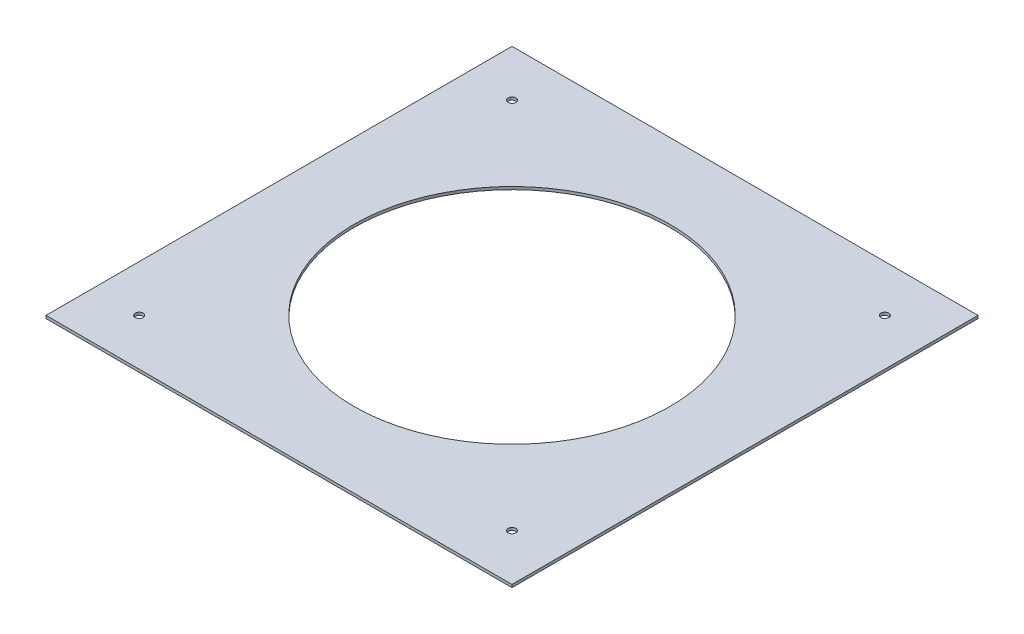
ISO-10303-21;
HEADER;
FILE_DESCRIPTION(('STEP AP214'),'2;1');
FILE_NAME('part.step','',(''),(''),'','','');
FILE_SCHEMA(('AUTOMOTIVE_DESIGN { 1 0 10303 214 1 1 1 1 }'));
ENDSEC;
DATA;
#1=APPLICATION_CONTEXT('core data for automotive mechanical design processes');
#2=APPLICATION_PROTOCOL_DEFINITION('international standard','automotive_design',2000,#1);
#3=PRODUCT_CONTEXT('',#1,'mechanical');
#4=PRODUCT('Part','Part','',(#3));
#5=PRODUCT_RELATED_PRODUCT_CATEGORY('part','',(#4));
#6=PRODUCT_DEFINITION_FORMATION('','',#4);
#7=PRODUCT_DEFINITION_CONTEXT('part definition',#1,'design');
#8=PRODUCT_DEFINITION('design','',#6,#7);
#9=PRODUCT_DEFINITION_SHAPE('','',#8);
#10=(LENGTH_UNIT() NAMED_UNIT(*) SI_UNIT(.MILLI.,.METRE.));
#11=(NAMED_UNIT(*) PLANE_ANGLE_UNIT() SI_UNIT($,.RADIAN.));
#12=(NAMED_UNIT(*) SI_UNIT($,.STERADIAN.) SOLID_ANGLE_UNIT());
#13=UNCERTAINTY_MEASURE_WITH_UNIT(LENGTH_MEASURE(1.E-05),#10,'distance_accuracy_value','');
#14=(GEOMETRIC_REPRESENTATION_CONTEXT(3) GLOBAL_UNCERTAINTY_ASSIGNED_CONTEXT((#13)) GLOBAL_UNIT_ASSIGNED_CONTEXT((#10,
#11,#12)) REPRESENTATION_CONTEXT('',''));
#15=CARTESIAN_POINT('',(0.,0.,0.));
#16=DIRECTION('',(0.,0.,1.));
#17=DIRECTION('',(1.,0.,0.));
#18=AXIS2_PLACEMENT_3D('',#15,#16,#17);
#19=CARTESIAN_POINT('',(0.,973.,0.));
#20=DIRECTION('',(0.,1.,0.));
#21=DIRECTION('',(0.,0.,1.));
#22=AXIS2_PLACEMENT_3D('',#19,#20,#21);
#23=PLANE('',#22);
#24=CARTESIAN_POINT('',(-100.,973.,100.));
#25=DIRECTION('',(0.,1.,0.));
#26=DIRECTION('',(0.,0.,-1.));
#27=AXIS2_PLACEMENT_3D('',#24,#25,#26);
#28=CIRCLE('',#27,2.1);
#29=CARTESIAN_POINT('',(-100.,973.,97.9));
#30=VERTEX_POINT('',#29);
#31=EDGE_CURVE('E131',#30,#30,#28,.T.);
#32=ORIENTED_EDGE('',*,*,#31,.F.);
#33=EDGE_LOOP('',(#32));
#34=FACE_BOUND('',#33,.T.);
#35=CARTESIAN_POINT('',(100.,973.,100.));
#36=DIRECTION('',(0.,1.,0.));
#37=DIRECTION('',(0.,0.,1.));
#38=AXIS2_PLACEMENT_3D('',#35,#36,#37);
#39=CIRCLE('',#38,2.1);
#40=CARTESIAN_POINT('',(100.,973.,102.1));
#41=VERTEX_POINT('',#40);
#42=EDGE_CURVE('E130',#41,#41,#39,.T.);
#43=ORIENTED_EDGE('',*,*,#42,.F.);
#44=EDGE_LOOP('',(#43));
#45=FACE_BOUND('',#44,.T.);
#46=CARTESIAN_POINT('',(100.,973.,-100.));
#47=DIRECTION('',(0.,1.,0.));
#48=DIRECTION('',(0.,0.,-1.));
#49=AXIS2_PLACEMENT_3D('',#46,#47,#48);
#50=CIRCLE('',#49,2.1);
#51=CARTESIAN_POINT('',(100.,973.,-102.1));
#52=VERTEX_POINT('',#51);
#53=EDGE_CURVE('E137',#52,#52,#50,.T.);
#54=ORIENTED_EDGE('',*,*,#53,.F.);
#55=EDGE_LOOP('',(#54));
#56=FACE_BOUND('',#55,.T.);
#57=CARTESIAN_POINT('',(-100.,973.,-100.));
#58=DIRECTION('',(0.,1.,0.));
#59=DIRECTION('',(0.,0.,1.));
#60=AXIS2_PLACEMENT_3D('',#57,#58,#59);
#61=CIRCLE('',#60,2.1);
#62=CARTESIAN_POINT('',(-100.,973.,-97.9));
#63=VERTEX_POINT('',#62);
#64=EDGE_CURVE('E123',#63,#63,#61,.T.);
#65=ORIENTED_EDGE('',*,*,#64,.F.);
#66=EDGE_LOOP('',(#65));
#67=FACE_BOUND('',#66,.T.);
#68=DIRECTION('',(0.,0.,1.));
#69=VECTOR('',#68,1.);
#70=CARTESIAN_POINT('',(-125.,973.,125.));
#71=LINE('',#70,#69);
#72=CARTESIAN_POINT('',(-125.,973.,-125.));
#73=VERTEX_POINT('',#72);
#74=CARTESIAN_POINT('',(-125.,973.,125.));
#75=VERTEX_POINT('',#74);
#76=EDGE_CURVE('E88',#73,#75,#71,.T.);
#77=ORIENTED_EDGE('',*,*,#76,.T.);
#78=DIRECTION('',(1.,0.,0.));
#79=VECTOR('',#78,1.);
#80=CARTESIAN_POINT('',(125.,973.,125.));
#81=LINE('',#80,#79);
#82=CARTESIAN_POINT('',(125.,973.,125.));
#83=VERTEX_POINT('',#82);
#84=EDGE_CURVE('E83',#75,#83,#81,.T.);
#85=ORIENTED_EDGE('',*,*,#84,.T.);
#86=DIRECTION('',(0.,0.,-1.));
#87=VECTOR('',#86,1.);
#88=CARTESIAN_POINT('',(125.,973.,125.));
#89=LINE('',#88,#87);
#90=CARTESIAN_POINT('',(125.,973.,-125.));
#91=VERTEX_POINT('',#90);
#92=EDGE_CURVE('E86',#83,#91,#89,.T.);
#93=ORIENTED_EDGE('',*,*,#92,.T.);
#94=DIRECTION('',(-1.,0.,0.));
#95=VECTOR('',#94,1.);
#96=CARTESIAN_POINT('',(125.,973.,-125.));
#97=LINE('',#96,#95);
#98=EDGE_CURVE('E53',#91,#73,#97,.T.);
#99=ORIENTED_EDGE('',*,*,#98,.T.);
#100=EDGE_LOOP('',(#77,#85,#93,#99));
#101=FACE_BOUND('',#100,.T.);
#102=CARTESIAN_POINT('',(0.,973.,0.));
#103=DIRECTION('',(0.,1.,0.));
#104=DIRECTION('',(0.,0.,1.));
#105=AXIS2_PLACEMENT_3D('',#102,#103,#104);
#106=CIRCLE('',#105,84.7000000000001);
#107=CARTESIAN_POINT('',(0.,973.,84.7000000000001));
#108=VERTEX_POINT('',#107);
#109=EDGE_CURVE('E103',#108,#108,#106,.T.);
#110=ORIENTED_EDGE('',*,*,#109,.F.);
#111=EDGE_LOOP('',(#110));
#112=FACE_BOUND('',#111,.T.);
#113=ADVANCED_FACE('F36',(#34,#45,#56,#67,#101,#112),#23,.T.);
#114=CARTESIAN_POINT('',(0.,971.5,0.));
#115=DIRECTION('',(0.,1.,0.));
#116=DIRECTION('',(0.,0.,1.));
#117=AXIS2_PLACEMENT_3D('',#114,#115,#116);
#118=PLANE('',#117);
#119=CARTESIAN_POINT('',(-100.,971.5,100.));
#120=DIRECTION('',(0.,1.,0.));
#121=DIRECTION('',(0.,0.,1.));
#122=AXIS2_PLACEMENT_3D('',#119,#120,#121);
#123=CIRCLE('',#122,2.1);
#124=CARTESIAN_POINT('',(-100.,971.5,102.1));
#125=VERTEX_POINT('',#124);
#126=EDGE_CURVE('E127',#125,#125,#123,.F.);
#127=ORIENTED_EDGE('',*,*,#126,.F.);
#128=EDGE_LOOP('',(#127));
#129=FACE_BOUND('',#128,.T.);
#130=CARTESIAN_POINT('',(100.,971.5,100.));
#131=DIRECTION('',(0.,1.,0.));
#132=DIRECTION('',(0.,0.,1.));
#133=AXIS2_PLACEMENT_3D('',#130,#131,#132);
#134=CIRCLE('',#133,2.1);
#135=CARTESIAN_POINT('',(100.,971.5,102.1));
#136=VERTEX_POINT('',#135);
#137=EDGE_CURVE('E134',#136,#136,#134,.F.);
#138=ORIENTED_EDGE('',*,*,#137,.F.);
#139=EDGE_LOOP('',(#138));
#140=FACE_BOUND('',#139,.T.);
#141=CARTESIAN_POINT('',(100.,971.5,-100.));
#142=DIRECTION('',(0.,1.,0.));
#143=DIRECTION('',(0.,0.,1.));
#144=AXIS2_PLACEMENT_3D('',#141,#142,#143);
#145=CIRCLE('',#144,2.1);
#146=CARTESIAN_POINT('',(100.,971.5,-97.9));
#147=VERTEX_POINT('',#146);
#148=EDGE_CURVE('E126',#147,#147,#145,.F.);
#149=ORIENTED_EDGE('',*,*,#148,.F.);
#150=EDGE_LOOP('',(#149));
#151=FACE_BOUND('',#150,.T.);
#152=CARTESIAN_POINT('',(-100.,971.5,-100.));
#153=DIRECTION('',(0.,1.,0.));
#154=DIRECTION('',(0.,0.,1.));
#155=AXIS2_PLACEMENT_3D('',#152,#153,#154);
#156=CIRCLE('',#155,2.1);
#157=CARTESIAN_POINT('',(-100.,971.5,-97.9));
#158=VERTEX_POINT('',#157);
#159=EDGE_CURVE('E118',#158,#158,#156,.F.);
#160=ORIENTED_EDGE('',*,*,#159,.F.);
#161=EDGE_LOOP('',(#160));
#162=FACE_BOUND('',#161,.T.);
#163=DIRECTION('',(0.,0.,1.));
#164=VECTOR('',#163,1.);
#165=CARTESIAN_POINT('',(-125.,971.5,125.));
#166=LINE('',#165,#164);
#167=CARTESIAN_POINT('',(-125.,971.5,-125.));
#168=VERTEX_POINT('',#167);
#169=CARTESIAN_POINT('',(-125.,971.5,125.));
#170=VERTEX_POINT('',#169);
#171=EDGE_CURVE('E100',#168,#170,#166,.T.);
#172=ORIENTED_EDGE('',*,*,#171,.F.);
#173=DIRECTION('',(-1.,0.,0.));
#174=VECTOR('',#173,1.);
#175=CARTESIAN_POINT('',(125.,971.5,-125.));
#176=LINE('',#175,#174);
#177=CARTESIAN_POINT('',(125.,971.5,-125.));
#178=VERTEX_POINT('',#177);
#179=EDGE_CURVE('E76',#178,#168,#176,.T.);
#180=ORIENTED_EDGE('',*,*,#179,.F.);
#181=DIRECTION('',(0.,0.,-1.));
#182=VECTOR('',#181,1.);
#183=CARTESIAN_POINT('',(125.,971.5,125.));
#184=LINE('',#183,#182);
#185=CARTESIAN_POINT('',(125.,971.5,125.));
#186=VERTEX_POINT('',#185);
#187=EDGE_CURVE('E70',#186,#178,#184,.T.);
#188=ORIENTED_EDGE('',*,*,#187,.F.);
#189=DIRECTION('',(1.,0.,0.));
#190=VECTOR('',#189,1.);
#191=CARTESIAN_POINT('',(125.,971.5,125.));
#192=LINE('',#191,#190);
#193=EDGE_CURVE('E92',#170,#186,#192,.T.);
#194=ORIENTED_EDGE('',*,*,#193,.F.);
#195=EDGE_LOOP('',(#172,#180,#188,#194));
#196=FACE_BOUND('',#195,.T.);
#197=CARTESIAN_POINT('',(0.,971.5,0.));
#198=DIRECTION('',(0.,1.,0.));
#199=DIRECTION('',(0.,0.,1.));
#200=AXIS2_PLACEMENT_3D('',#197,#198,#199);
#201=CIRCLE('',#200,84.7000000000001);
#202=CARTESIAN_POINT('',(0.,971.5,84.7000000000001));
#203=VERTEX_POINT('',#202);
#204=EDGE_CURVE('E115',#203,#203,#201,.T.);
#205=ORIENTED_EDGE('',*,*,#204,.T.);
#206=EDGE_LOOP('',(#205));
#207=FACE_BOUND('',#206,.T.);
#208=ADVANCED_FACE('F111',(#129,#140,#151,#162,#196,#207),#118,.F.);
#209=CARTESIAN_POINT('',(-125.,973.,125.));
#210=DIRECTION('',(1.,0.,0.));
#211=DIRECTION('',(0.,0.,-1.));
#212=AXIS2_PLACEMENT_3D('',#209,#210,#211);
#213=PLANE('',#212);
#214=ORIENTED_EDGE('',*,*,#171,.T.);
#215=DIRECTION('',(0.,-1.,0.));
#216=VECTOR('',#215,1.);
#217=CARTESIAN_POINT('',(-125.,973.,125.));
#218=LINE('',#217,#216);
#219=EDGE_CURVE('E11',#75,#170,#218,.T.);
#220=ORIENTED_EDGE('',*,*,#219,.F.);
#221=ORIENTED_EDGE('',*,*,#76,.F.);
#222=DIRECTION('',(0.,-1.,0.));
#223=VECTOR('',#222,1.);
#224=CARTESIAN_POINT('',(-125.,973.,-125.));
#225=LINE('',#224,#223);
#226=EDGE_CURVE('E96',#73,#168,#225,.T.);
#227=ORIENTED_EDGE('',*,*,#226,.T.);
#228=EDGE_LOOP('',(#214,#220,#221,#227));
#229=FACE_BOUND('',#228,.T.);
#230=ADVANCED_FACE('F38',(#229),#213,.F.);
#231=CARTESIAN_POINT('',(125.,973.,125.));
#232=DIRECTION('',(0.,0.,-1.));
#233=DIRECTION('',(-1.,0.,0.));
#234=AXIS2_PLACEMENT_3D('',#231,#232,#233);
#235=PLANE('',#234);
#236=ORIENTED_EDGE('',*,*,#193,.T.);
#237=DIRECTION('',(0.,-1.,0.));
#238=VECTOR('',#237,1.);
#239=CARTESIAN_POINT('',(125.,973.,125.));
#240=LINE('',#239,#238);
#241=EDGE_CURVE('E45',#83,#186,#240,.T.);
#242=ORIENTED_EDGE('',*,*,#241,.F.);
#243=ORIENTED_EDGE('',*,*,#84,.F.);
#244=ORIENTED_EDGE('',*,*,#219,.T.);
#245=EDGE_LOOP('',(#236,#242,#243,#244));
#246=FACE_BOUND('',#245,.T.);
#247=ADVANCED_FACE('F91',(#246),#235,.F.);
#248=CARTESIAN_POINT('',(125.,973.,125.));
#249=DIRECTION('',(-1.,0.,0.));
#250=DIRECTION('',(0.,0.,1.));
#251=AXIS2_PLACEMENT_3D('',#248,#249,#250);
#252=PLANE('',#251);
#253=ORIENTED_EDGE('',*,*,#187,.T.);
#254=DIRECTION('',(0.,-1.,0.));
#255=VECTOR('',#254,1.);
#256=CARTESIAN_POINT('',(125.,973.,-125.));
#257=LINE('',#256,#255);
#258=EDGE_CURVE('E93',#91,#178,#257,.T.);
#259=ORIENTED_EDGE('',*,*,#258,.F.);
#260=ORIENTED_EDGE('',*,*,#92,.F.);
#261=ORIENTED_EDGE('',*,*,#241,.T.);
#262=EDGE_LOOP('',(#253,#259,#260,#261));
#263=FACE_BOUND('',#262,.T.);
#264=ADVANCED_FACE('F94',(#263),#252,.F.);
#265=CARTESIAN_POINT('',(125.,973.,-125.));
#266=DIRECTION('',(0.,0.,1.));
#267=DIRECTION('',(1.,0.,0.));
#268=AXIS2_PLACEMENT_3D('',#265,#266,#267);
#269=PLANE('',#268);
#270=ORIENTED_EDGE('',*,*,#179,.T.);
#271=ORIENTED_EDGE('',*,*,#226,.F.);
#272=ORIENTED_EDGE('',*,*,#98,.F.);
#273=ORIENTED_EDGE('',*,*,#258,.T.);
#274=EDGE_LOOP('',(#270,#271,#272,#273));
#275=FACE_BOUND('',#274,.T.);
#276=ADVANCED_FACE('F108',(#275),#269,.F.);
#277=CARTESIAN_POINT('',(0.,973.,0.));
#278=DIRECTION('',(0.,-1.,0.));
#279=DIRECTION('',(0.,0.,-1.));
#280=AXIS2_PLACEMENT_3D('',#277,#278,#279);
#281=CYLINDRICAL_SURFACE('',#280,84.7000000000001);
#282=ORIENTED_EDGE('',*,*,#109,.T.);
#283=EDGE_LOOP('',(#282));
#284=FACE_BOUND('',#283,.T.);
#285=ORIENTED_EDGE('',*,*,#204,.F.);
#286=EDGE_LOOP('',(#285));
#287=FACE_BOUND('',#286,.T.);
#288=ADVANCED_FACE('F157',(#284,#287),#281,.F.);
#289=CARTESIAN_POINT('',(-100.,-36.0010000000002,-100.));
#290=DIRECTION('',(0.,1.,0.));
#291=DIRECTION('',(0.,0.,1.));
#292=AXIS2_PLACEMENT_3D('',#289,#290,#291);
#293=CYLINDRICAL_SURFACE('',#292,2.1);
#294=ORIENTED_EDGE('',*,*,#64,.T.);
#295=EDGE_LOOP('',(#294));
#296=FACE_BOUND('',#295,.T.);
#297=ORIENTED_EDGE('',*,*,#159,.T.);
#298=EDGE_LOOP('',(#297));
#299=FACE_BOUND('',#298,.T.);
#300=ADVANCED_FACE('F154',(#296,#299),#293,.F.);
#301=CARTESIAN_POINT('',(100.,-36.0010000000002,-100.));
#302=DIRECTION('',(0.,1.,0.));
#303=DIRECTION('',(0.,0.,1.));
#304=AXIS2_PLACEMENT_3D('',#301,#302,#303);
#305=CYLINDRICAL_SURFACE('',#304,2.1);
#306=ORIENTED_EDGE('',*,*,#53,.T.);
#307=EDGE_LOOP('',(#306));
#308=FACE_BOUND('',#307,.T.);
#309=ORIENTED_EDGE('',*,*,#148,.T.);
#310=EDGE_LOOP('',(#309));
#311=FACE_BOUND('',#310,.T.);
#312=ADVANCED_FACE('F145',(#308,#311),#305,.F.);
#313=CARTESIAN_POINT('',(100.,-36.0010000000002,100.));
#314=DIRECTION('',(0.,1.,0.));
#315=DIRECTION('',(0.,0.,1.));
#316=AXIS2_PLACEMENT_3D('',#313,#314,#315);
#317=CYLINDRICAL_SURFACE('',#316,2.1);
#318=ORIENTED_EDGE('',*,*,#42,.T.);
#319=EDGE_LOOP('',(#318));
#320=FACE_BOUND('',#319,.T.);
#321=ORIENTED_EDGE('',*,*,#137,.T.);
#322=EDGE_LOOP('',(#321));
#323=FACE_BOUND('',#322,.T.);
#324=ADVANCED_FACE('F208',(#320,#323),#317,.F.);
#325=CARTESIAN_POINT('',(-100.,-36.0010000000002,100.));
#326=DIRECTION('',(0.,1.,0.));
#327=DIRECTION('',(0.,0.,1.));
#328=AXIS2_PLACEMENT_3D('',#325,#326,#327);
#329=CYLINDRICAL_SURFACE('',#328,2.1);
#330=ORIENTED_EDGE('',*,*,#31,.T.);
#331=EDGE_LOOP('',(#330));
#332=FACE_BOUND('',#331,.T.);
#333=ORIENTED_EDGE('',*,*,#126,.T.);
#334=EDGE_LOOP('',(#333));
#335=FACE_BOUND('',#334,.T.);
#336=ADVANCED_FACE('F216',(#332,#335),#329,.F.);
#337=CLOSED_SHELL('',(#113,#208,#230,#247,#264,#276,#288,#300,#312,#324,#336));
#338=MANIFOLD_SOLID_BREP('B2',#337);
#339=ADVANCED_BREP_SHAPE_REPRESENTATION('',(#18,#338),#14);
#340=SHAPE_DEFINITION_REPRESENTATION(#9,#339);
ENDSEC;
END-ISO-10303-21;
